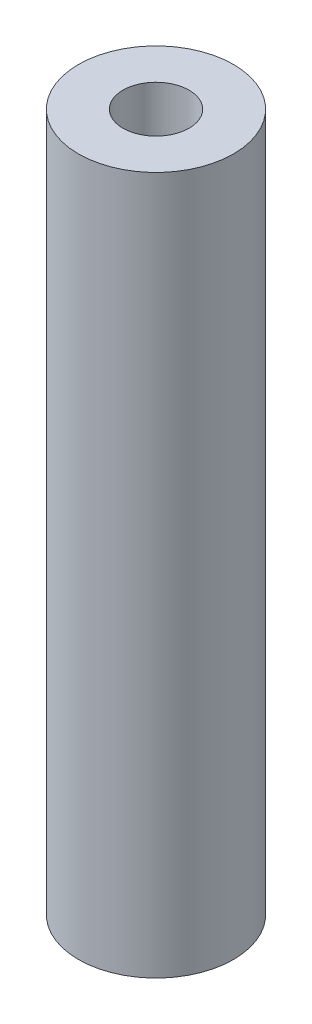
ISO-10303-21;
HEADER;
FILE_DESCRIPTION(('STEP AP214'),'2;1');
FILE_NAME('part.step','',(''),(''),'','','');
FILE_SCHEMA(('AUTOMOTIVE_DESIGN { 1 0 10303 214 1 1 1 1 }'));
ENDSEC;
DATA;
#1=APPLICATION_CONTEXT('core data for automotive mechanical design processes');
#2=APPLICATION_PROTOCOL_DEFINITION('international standard','automotive_design',2000,#1);
#3=PRODUCT_CONTEXT('',#1,'mechanical');
#4=PRODUCT('Part','Part','',(#3));
#5=PRODUCT_RELATED_PRODUCT_CATEGORY('part','',(#4));
#6=PRODUCT_DEFINITION_FORMATION('','',#4);
#7=PRODUCT_DEFINITION_CONTEXT('part definition',#1,'design');
#8=PRODUCT_DEFINITION('design','',#6,#7);
#9=PRODUCT_DEFINITION_SHAPE('','',#8);
#10=(LENGTH_UNIT() NAMED_UNIT(*) SI_UNIT(.MILLI.,.METRE.));
#11=(NAMED_UNIT(*) PLANE_ANGLE_UNIT() SI_UNIT($,.RADIAN.));
#12=(NAMED_UNIT(*) SI_UNIT($,.STERADIAN.) SOLID_ANGLE_UNIT());
#13=UNCERTAINTY_MEASURE_WITH_UNIT(LENGTH_MEASURE(1.E-05),#10,'distance_accuracy_value','');
#14=(GEOMETRIC_REPRESENTATION_CONTEXT(3) GLOBAL_UNCERTAINTY_ASSIGNED_CONTEXT((#13)) GLOBAL_UNIT_ASSIGNED_CONTEXT((#10,
#11,#12)) REPRESENTATION_CONTEXT('',''));
#15=CARTESIAN_POINT('',(0.,0.,0.));
#16=DIRECTION('',(0.,0.,1.));
#17=DIRECTION('',(1.,0.,0.));
#18=AXIS2_PLACEMENT_3D('',#15,#16,#17);
#19=CARTESIAN_POINT('',(0.,28.575,0.));
#20=DIRECTION('',(0.,-1.,0.));
#21=DIRECTION('',(0.,0.,-1.));
#22=AXIS2_PLACEMENT_3D('',#19,#20,#21);
#23=CYLINDRICAL_SURFACE('',#22,3.175);
#24=CARTESIAN_POINT('',(0.,28.575,0.));
#25=DIRECTION('',(0.,1.,0.));
#26=DIRECTION('',(0.,0.,1.));
#27=AXIS2_PLACEMENT_3D('',#24,#25,#26);
#28=CIRCLE('',#27,3.175);
#29=CARTESIAN_POINT('',(0.,28.575,3.175));
#30=VERTEX_POINT('',#29);
#31=EDGE_CURVE('E10',#30,#30,#28,.T.);
#32=ORIENTED_EDGE('',*,*,#31,.F.);
#33=EDGE_LOOP('',(#32));
#34=FACE_BOUND('',#33,.T.);
#35=CARTESIAN_POINT('',(0.,0.,0.));
#36=DIRECTION('',(0.,1.,0.));
#37=DIRECTION('',(0.,0.,1.));
#38=AXIS2_PLACEMENT_3D('',#35,#36,#37);
#39=CIRCLE('',#38,3.175);
#40=CARTESIAN_POINT('',(0.,0.,3.175));
#41=VERTEX_POINT('',#40);
#42=EDGE_CURVE('E33',#41,#41,#39,.T.);
#43=ORIENTED_EDGE('',*,*,#42,.T.);
#44=EDGE_LOOP('',(#43));
#45=FACE_BOUND('',#44,.T.);
#46=ADVANCED_FACE('F30',(#34,#45),#23,.T.);
#47=CARTESIAN_POINT('',(0.,28.575,0.));
#48=DIRECTION('',(0.,1.,0.));
#49=DIRECTION('',(0.,0.,1.));
#50=AXIS2_PLACEMENT_3D('',#47,#48,#49);
#51=PLANE('',#50);
#52=CARTESIAN_POINT('',(0.,28.575,0.));
#53=DIRECTION('',(0.,1.,0.));
#54=DIRECTION('',(0.,0.,1.));
#55=AXIS2_PLACEMENT_3D('',#52,#53,#54);
#56=CIRCLE('',#55,1.35254999999999);
#57=CARTESIAN_POINT('',(0.,28.575,1.35254999999999));
#58=VERTEX_POINT('',#57);
#59=EDGE_CURVE('E44',#58,#58,#56,.T.);
#60=ORIENTED_EDGE('',*,*,#59,.F.);
#61=EDGE_LOOP('',(#60));
#62=FACE_BOUND('',#61,.T.);
#63=ORIENTED_EDGE('',*,*,#31,.T.);
#64=EDGE_LOOP('',(#63));
#65=FACE_BOUND('',#64,.T.);
#66=ADVANCED_FACE('F50',(#62,#65),#51,.T.);
#67=CARTESIAN_POINT('',(0.,0.,0.));
#68=DIRECTION('',(0.,1.,0.));
#69=DIRECTION('',(0.,0.,1.));
#70=AXIS2_PLACEMENT_3D('',#67,#68,#69);
#71=PLANE('',#70);
#72=CARTESIAN_POINT('',(0.,0.,0.));
#73=DIRECTION('',(0.,1.,0.));
#74=DIRECTION('',(0.,0.,1.));
#75=AXIS2_PLACEMENT_3D('',#72,#73,#74);
#76=CIRCLE('',#75,1.35254999999999);
#77=CARTESIAN_POINT('',(0.,0.,1.35254999999999));
#78=VERTEX_POINT('',#77);
#79=EDGE_CURVE('E40',#78,#78,#76,.T.);
#80=ORIENTED_EDGE('',*,*,#79,.T.);
#81=EDGE_LOOP('',(#80));
#82=FACE_BOUND('',#81,.T.);
#83=ORIENTED_EDGE('',*,*,#42,.F.);
#84=EDGE_LOOP('',(#83));
#85=FACE_BOUND('',#84,.T.);
#86=ADVANCED_FACE('F52',(#82,#85),#71,.F.);
#87=CARTESIAN_POINT('',(0.,28.575,0.));
#88=DIRECTION('',(0.,1.,0.));
#89=DIRECTION('',(0.,0.,1.));
#90=AXIS2_PLACEMENT_3D('',#87,#88,#89);
#91=CYLINDRICAL_SURFACE('',#90,1.35254999999999);
#92=ORIENTED_EDGE('',*,*,#79,.F.);
#93=EDGE_LOOP('',(#92));
#94=FACE_BOUND('',#93,.T.);
#95=ORIENTED_EDGE('',*,*,#59,.T.);
#96=EDGE_LOOP('',(#95));
#97=FACE_BOUND('',#96,.T.);
#98=ADVANCED_FACE('F48',(#94,#97),#91,.F.);
#99=CLOSED_SHELL('',(#46,#66,#86,#98));
#100=MANIFOLD_SOLID_BREP('B2',#99);
#101=ADVANCED_BREP_SHAPE_REPRESENTATION('',(#18,#100),#14);
#102=SHAPE_DEFINITION_REPRESENTATION(#9,#101);
ENDSEC;
END-ISO-10303-21;
